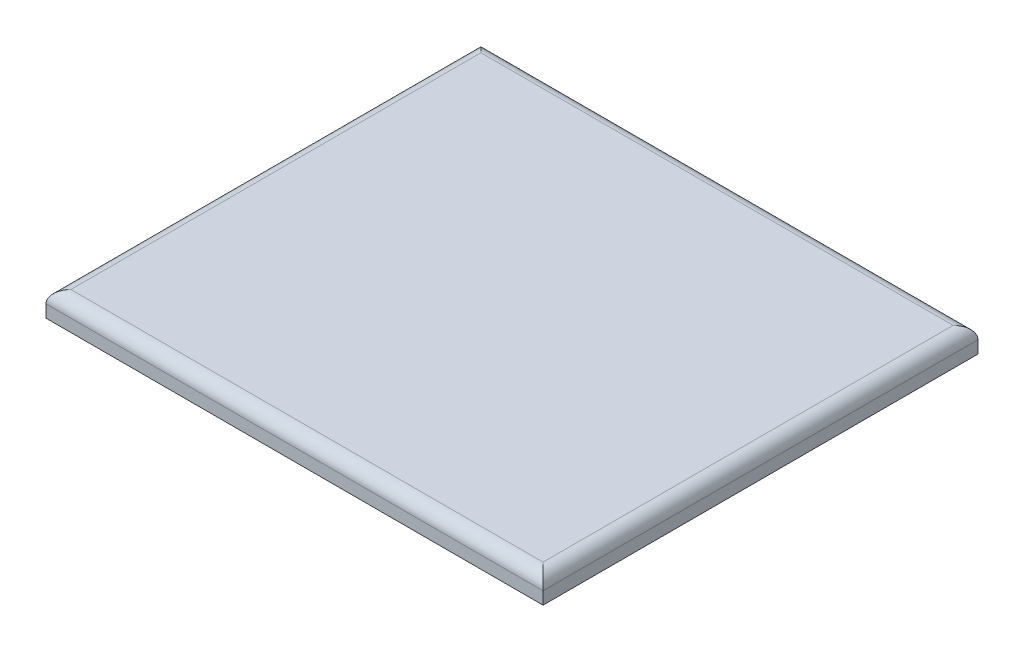
ISO-10303-21;
HEADER;
FILE_DESCRIPTION(('STEP AP214'),'2;1');
FILE_NAME('part.step','',(''),(''),'','','');
FILE_SCHEMA(('AUTOMOTIVE_DESIGN { 1 0 10303 214 1 1 1 1 }'));
ENDSEC;
DATA;
#1=APPLICATION_CONTEXT('core data for automotive mechanical design processes');
#2=APPLICATION_PROTOCOL_DEFINITION('international standard','automotive_design',2000,#1);
#3=PRODUCT_CONTEXT('',#1,'mechanical');
#4=PRODUCT('Part','Part','',(#3));
#5=PRODUCT_RELATED_PRODUCT_CATEGORY('part','',(#4));
#6=PRODUCT_DEFINITION_FORMATION('','',#4);
#7=PRODUCT_DEFINITION_CONTEXT('part definition',#1,'design');
#8=PRODUCT_DEFINITION('design','',#6,#7);
#9=PRODUCT_DEFINITION_SHAPE('','',#8);
#10=(LENGTH_UNIT() NAMED_UNIT(*) SI_UNIT(.MILLI.,.METRE.));
#11=(NAMED_UNIT(*) PLANE_ANGLE_UNIT() SI_UNIT($,.RADIAN.));
#12=(NAMED_UNIT(*) SI_UNIT($,.STERADIAN.) SOLID_ANGLE_UNIT());
#13=UNCERTAINTY_MEASURE_WITH_UNIT(LENGTH_MEASURE(1.E-05),#10,'distance_accuracy_value','');
#14=(GEOMETRIC_REPRESENTATION_CONTEXT(3) GLOBAL_UNCERTAINTY_ASSIGNED_CONTEXT((#13)) GLOBAL_UNIT_ASSIGNED_CONTEXT((#10,
#11,#12)) REPRESENTATION_CONTEXT('',''));
#15=CARTESIAN_POINT('',(0.,0.,0.));
#16=DIRECTION('',(0.,0.,1.));
#17=DIRECTION('',(1.,0.,0.));
#18=AXIS2_PLACEMENT_3D('',#15,#16,#17);
#19=CARTESIAN_POINT('',(200.,20.,175.));
#20=DIRECTION('',(-1.,0.,0.));
#21=DIRECTION('',(0.,0.,1.));
#22=AXIS2_PLACEMENT_3D('',#19,#20,#21);
#23=PLANE('',#22);
#24=DIRECTION('',(0.,-1.,0.));
#25=VECTOR('',#24,1.);
#26=CARTESIAN_POINT('',(200.,20.,-175.));
#27=LINE('',#26,#25);
#28=CARTESIAN_POINT('',(200.,10.,-175.));
#29=VERTEX_POINT('',#28);
#30=CARTESIAN_POINT('',(200.,0.,-175.));
#31=VERTEX_POINT('',#30);
#32=EDGE_CURVE('E88',#29,#31,#27,.T.);
#33=ORIENTED_EDGE('',*,*,#32,.F.);
#34=DIRECTION('',(0.,0.,-1.));
#35=VECTOR('',#34,1.);
#36=CARTESIAN_POINT('',(200.,10.,175.));
#37=LINE('',#36,#35);
#38=CARTESIAN_POINT('',(200.,10.,175.));
#39=VERTEX_POINT('',#38);
#40=EDGE_CURVE('E11',#29,#39,#37,.F.);
#41=ORIENTED_EDGE('',*,*,#40,.T.);
#42=DIRECTION('',(0.,-1.,0.));
#43=VECTOR('',#42,1.);
#44=CARTESIAN_POINT('',(200.,20.,175.));
#45=LINE('',#44,#43);
#46=CARTESIAN_POINT('',(200.,0.,175.));
#47=VERTEX_POINT('',#46);
#48=EDGE_CURVE('E108',#39,#47,#45,.T.);
#49=ORIENTED_EDGE('',*,*,#48,.T.);
#50=DIRECTION('',(0.,0.,-1.));
#51=VECTOR('',#50,1.);
#52=CARTESIAN_POINT('',(200.,0.,175.));
#53=LINE('',#52,#51);
#54=EDGE_CURVE('E103',#47,#31,#53,.T.);
#55=ORIENTED_EDGE('',*,*,#54,.T.);
#56=EDGE_LOOP('',(#33,#41,#49,#55));
#57=FACE_BOUND('',#56,.T.);
#58=ADVANCED_FACE('F36',(#57),#23,.F.);
#59=CARTESIAN_POINT('',(-200.,20.,-175.));
#60=DIRECTION('',(0.,0.,1.));
#61=DIRECTION('',(1.,0.,0.));
#62=AXIS2_PLACEMENT_3D('',#59,#60,#61);
#63=PLANE('',#62);
#64=DIRECTION('',(0.,-1.,0.));
#65=VECTOR('',#64,1.);
#66=CARTESIAN_POINT('',(-200.,20.,-175.));
#67=LINE('',#66,#65);
#68=CARTESIAN_POINT('',(-200.,10.,-175.));
#69=VERTEX_POINT('',#68);
#70=CARTESIAN_POINT('',(-200.,0.,-175.));
#71=VERTEX_POINT('',#70);
#72=EDGE_CURVE('E97',#69,#71,#67,.T.);
#73=ORIENTED_EDGE('',*,*,#72,.F.);
#74=DIRECTION('',(-1.,0.,0.));
#75=VECTOR('',#74,1.);
#76=CARTESIAN_POINT('',(-200.,10.,-175.));
#77=LINE('',#76,#75);
#78=EDGE_CURVE('E45',#69,#29,#77,.F.);
#79=ORIENTED_EDGE('',*,*,#78,.T.);
#80=ORIENTED_EDGE('',*,*,#32,.T.);
#81=DIRECTION('',(-1.,0.,0.));
#82=VECTOR('',#81,1.);
#83=CARTESIAN_POINT('',(-200.,0.,-175.));
#84=LINE('',#83,#82);
#85=EDGE_CURVE('E91',#31,#71,#84,.T.);
#86=ORIENTED_EDGE('',*,*,#85,.T.);
#87=EDGE_LOOP('',(#73,#79,#80,#86));
#88=FACE_BOUND('',#87,.T.);
#89=ADVANCED_FACE('F90',(#88),#63,.F.);
#90=CARTESIAN_POINT('',(-200.,20.,175.));
#91=DIRECTION('',(1.,0.,0.));
#92=DIRECTION('',(0.,0.,-1.));
#93=AXIS2_PLACEMENT_3D('',#90,#91,#92);
#94=PLANE('',#93);
#95=DIRECTION('',(0.,-1.,0.));
#96=VECTOR('',#95,1.);
#97=CARTESIAN_POINT('',(-200.,20.,175.));
#98=LINE('',#97,#96);
#99=CARTESIAN_POINT('',(-200.,10.,175.));
#100=VERTEX_POINT('',#99);
#101=CARTESIAN_POINT('',(-200.,0.,175.));
#102=VERTEX_POINT('',#101);
#103=EDGE_CURVE('E118',#100,#102,#98,.T.);
#104=ORIENTED_EDGE('',*,*,#103,.F.);
#105=DIRECTION('',(0.,0.,1.));
#106=VECTOR('',#105,1.);
#107=CARTESIAN_POINT('',(-200.,10.,175.));
#108=LINE('',#107,#106);
#109=EDGE_CURVE('E60',#100,#69,#108,.F.);
#110=ORIENTED_EDGE('',*,*,#109,.T.);
#111=ORIENTED_EDGE('',*,*,#72,.T.);
#112=DIRECTION('',(0.,0.,1.));
#113=VECTOR('',#112,1.);
#114=CARTESIAN_POINT('',(-200.,0.,175.));
#115=LINE('',#114,#113);
#116=EDGE_CURVE('E105',#71,#102,#115,.T.);
#117=ORIENTED_EDGE('',*,*,#116,.T.);
#118=EDGE_LOOP('',(#104,#110,#111,#117));
#119=FACE_BOUND('',#118,.T.);
#120=ADVANCED_FACE('F156',(#119),#94,.F.);
#121=CARTESIAN_POINT('',(-200.,20.,175.));
#122=DIRECTION('',(0.,0.,-1.));
#123=DIRECTION('',(-1.,0.,0.));
#124=AXIS2_PLACEMENT_3D('',#121,#122,#123);
#125=PLANE('',#124);
#126=ORIENTED_EDGE('',*,*,#48,.F.);
#127=DIRECTION('',(1.,0.,0.));
#128=VECTOR('',#127,1.);
#129=CARTESIAN_POINT('',(-200.,10.,175.));
#130=LINE('',#129,#128);
#131=EDGE_CURVE('E129',#39,#100,#130,.F.);
#132=ORIENTED_EDGE('',*,*,#131,.T.);
#133=ORIENTED_EDGE('',*,*,#103,.T.);
#134=DIRECTION('',(1.,0.,0.));
#135=VECTOR('',#134,1.);
#136=CARTESIAN_POINT('',(-200.,0.,175.));
#137=LINE('',#136,#135);
#138=EDGE_CURVE('E115',#102,#47,#137,.T.);
#139=ORIENTED_EDGE('',*,*,#138,.T.);
#140=EDGE_LOOP('',(#126,#132,#133,#139));
#141=FACE_BOUND('',#140,.T.);
#142=ADVANCED_FACE('F155',(#141),#125,.F.);
#143=CARTESIAN_POINT('',(0.,20.,0.));
#144=DIRECTION('',(0.,-1.,0.));
#145=DIRECTION('',(0.,0.,-1.));
#146=AXIS2_PLACEMENT_3D('',#143,#144,#145);
#147=PLANE('',#146);
#148=DIRECTION('',(0.,0.,1.));
#149=VECTOR('',#148,1.);
#150=CARTESIAN_POINT('',(-190.,20.,0.));
#151=LINE('',#150,#149);
#152=CARTESIAN_POINT('',(-190.,20.,-165.));
#153=VERTEX_POINT('',#152);
#154=CARTESIAN_POINT('',(-190.,20.,165.));
#155=VERTEX_POINT('',#154);
#156=EDGE_CURVE('E124',#153,#155,#151,.T.);
#157=ORIENTED_EDGE('',*,*,#156,.T.);
#158=DIRECTION('',(1.,0.,0.));
#159=VECTOR('',#158,1.);
#160=CARTESIAN_POINT('',(0.,20.,165.));
#161=LINE('',#160,#159);
#162=CARTESIAN_POINT('',(190.,20.,165.));
#163=VERTEX_POINT('',#162);
#164=EDGE_CURVE('E126',#155,#163,#161,.T.);
#165=ORIENTED_EDGE('',*,*,#164,.T.);
#166=DIRECTION('',(0.,0.,-1.));
#167=VECTOR('',#166,1.);
#168=CARTESIAN_POINT('',(190.,20.,0.));
#169=LINE('',#168,#167);
#170=CARTESIAN_POINT('',(190.,20.,-165.));
#171=VERTEX_POINT('',#170);
#172=EDGE_CURVE('E96',#163,#171,#169,.T.);
#173=ORIENTED_EDGE('',*,*,#172,.T.);
#174=DIRECTION('',(-1.,0.,0.));
#175=VECTOR('',#174,1.);
#176=CARTESIAN_POINT('',(0.,20.,-165.));
#177=LINE('',#176,#175);
#178=EDGE_CURVE('E122',#171,#153,#177,.T.);
#179=ORIENTED_EDGE('',*,*,#178,.T.);
#180=EDGE_LOOP('',(#157,#165,#173,#179));
#181=FACE_BOUND('',#180,.T.);
#182=ADVANCED_FACE('F148',(#181),#147,.F.);
#183=CARTESIAN_POINT('',(0.,0.,0.));
#184=DIRECTION('',(0.,-1.,0.));
#185=DIRECTION('',(0.,0.,-1.));
#186=AXIS2_PLACEMENT_3D('',#183,#184,#185);
#187=PLANE('',#186);
#188=ORIENTED_EDGE('',*,*,#54,.F.);
#189=ORIENTED_EDGE('',*,*,#138,.F.);
#190=ORIENTED_EDGE('',*,*,#116,.F.);
#191=ORIENTED_EDGE('',*,*,#85,.F.);
#192=EDGE_LOOP('',(#188,#189,#190,#191));
#193=FACE_BOUND('',#192,.T.);
#194=ADVANCED_FACE('F101',(#193),#187,.T.);
#195=CARTESIAN_POINT('',(0.,10.,-165.));
#196=DIRECTION('',(-1.,0.,0.));
#197=DIRECTION('',(0.,0.,1.));
#198=AXIS2_PLACEMENT_3D('',#195,#196,#197);
#199=CYLINDRICAL_SURFACE('',#198,10.);
#200=CARTESIAN_POINT('',(190.,10.,-165.));
#201=DIRECTION('',(-0.707106781186547,0.,-0.707106781186547));
#202=DIRECTION('',(0.707106781186547,0.,-0.707106781186547));
#203=AXIS2_PLACEMENT_3D('',#200,#201,#202);
#204=ELLIPSE('',#203,14.1421356237309,10.);
#205=EDGE_CURVE('E112',#29,#171,#204,.F.);
#206=ORIENTED_EDGE('',*,*,#205,.F.);
#207=ORIENTED_EDGE('',*,*,#78,.F.);
#208=CARTESIAN_POINT('',(-190.,10.,-165.));
#209=DIRECTION('',(-0.707106781186547,0.,0.707106781186547));
#210=DIRECTION('',(-0.707106781186547,0.,-0.707106781186547));
#211=AXIS2_PLACEMENT_3D('',#208,#209,#210);
#212=ELLIPSE('',#211,14.1421356237309,10.);
#213=EDGE_CURVE('E40',#153,#69,#212,.T.);
#214=ORIENTED_EDGE('',*,*,#213,.F.);
#215=ORIENTED_EDGE('',*,*,#178,.F.);
#216=EDGE_LOOP('',(#206,#207,#214,#215));
#217=FACE_BOUND('',#216,.T.);
#218=ADVANCED_FACE('F38',(#217),#199,.T.);
#219=CARTESIAN_POINT('',(-190.,10.,0.));
#220=DIRECTION('',(0.,0.,1.));
#221=DIRECTION('',(1.,0.,0.));
#222=AXIS2_PLACEMENT_3D('',#219,#220,#221);
#223=CYLINDRICAL_SURFACE('',#222,10.);
#224=ORIENTED_EDGE('',*,*,#213,.T.);
#225=ORIENTED_EDGE('',*,*,#109,.F.);
#226=CARTESIAN_POINT('',(-190.,10.,165.));
#227=DIRECTION('',(0.707106781186547,0.,0.707106781186547));
#228=DIRECTION('',(-0.707106781186547,0.,0.707106781186547));
#229=AXIS2_PLACEMENT_3D('',#226,#227,#228);
#230=ELLIPSE('',#229,14.1421356237309,10.);
#231=EDGE_CURVE('E136',#155,#100,#230,.T.);
#232=ORIENTED_EDGE('',*,*,#231,.F.);
#233=ORIENTED_EDGE('',*,*,#156,.F.);
#234=EDGE_LOOP('',(#224,#225,#232,#233));
#235=FACE_BOUND('',#234,.T.);
#236=ADVANCED_FACE('F173',(#235),#223,.T.);
#237=CARTESIAN_POINT('',(190.,10.,0.));
#238=DIRECTION('',(0.,0.,-1.));
#239=DIRECTION('',(-1.,0.,0.));
#240=AXIS2_PLACEMENT_3D('',#237,#238,#239);
#241=CYLINDRICAL_SURFACE('',#240,10.);
#242=ORIENTED_EDGE('',*,*,#205,.T.);
#243=ORIENTED_EDGE('',*,*,#172,.F.);
#244=CARTESIAN_POINT('',(190.,10.,165.));
#245=DIRECTION('',(0.707106781186547,0.,-0.707106781186547));
#246=DIRECTION('',(-0.707106781186547,0.,-0.707106781186547));
#247=AXIS2_PLACEMENT_3D('',#244,#245,#246);
#248=ELLIPSE('',#247,14.1421356237309,10.);
#249=EDGE_CURVE('E134',#39,#163,#248,.F.);
#250=ORIENTED_EDGE('',*,*,#249,.F.);
#251=ORIENTED_EDGE('',*,*,#40,.F.);
#252=EDGE_LOOP('',(#242,#243,#250,#251));
#253=FACE_BOUND('',#252,.T.);
#254=ADVANCED_FACE('F141',(#253),#241,.T.);
#255=CARTESIAN_POINT('',(0.,10.,165.));
#256=DIRECTION('',(1.,0.,0.));
#257=DIRECTION('',(0.,0.,-1.));
#258=AXIS2_PLACEMENT_3D('',#255,#256,#257);
#259=CYLINDRICAL_SURFACE('',#258,10.);
#260=ORIENTED_EDGE('',*,*,#231,.T.);
#261=ORIENTED_EDGE('',*,*,#131,.F.);
#262=ORIENTED_EDGE('',*,*,#249,.T.);
#263=ORIENTED_EDGE('',*,*,#164,.F.);
#264=EDGE_LOOP('',(#260,#261,#262,#263));
#265=FACE_BOUND('',#264,.T.);
#266=ADVANCED_FACE('F152',(#265),#259,.T.);
#267=CLOSED_SHELL('',(#58,#89,#120,#142,#182,#194,#218,#236,#254,#266));
#268=MANIFOLD_SOLID_BREP('B2',#267);
#269=ADVANCED_BREP_SHAPE_REPRESENTATION('',(#18,#268),#14);
#270=SHAPE_DEFINITION_REPRESENTATION(#9,#269);
ENDSEC;
END-ISO-10303-21;
